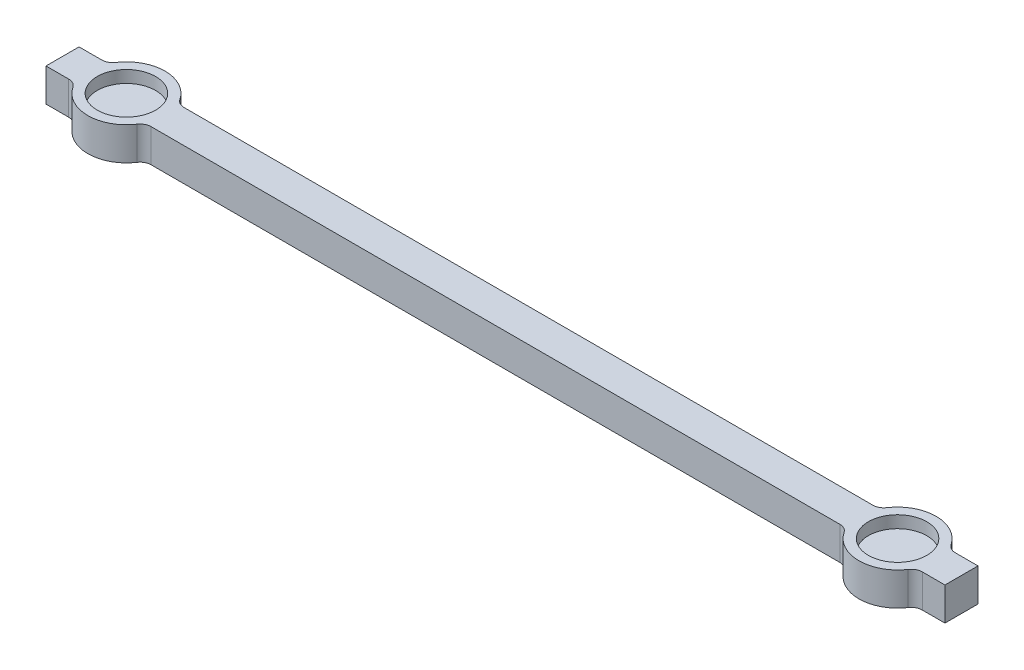
ISO-10303-21;
HEADER;
FILE_DESCRIPTION(('STEP AP214'),'2;1');
FILE_NAME('part.step','',(''),(''),'','','');
FILE_SCHEMA(('AUTOMOTIVE_DESIGN { 1 0 10303 214 1 1 1 1 }'));
ENDSEC;
DATA;
#1=APPLICATION_CONTEXT('core data for automotive mechanical design processes');
#2=APPLICATION_PROTOCOL_DEFINITION('international standard','automotive_design',2000,#1);
#3=PRODUCT_CONTEXT('',#1,'mechanical');
#4=PRODUCT('Part','Part','',(#3));
#5=PRODUCT_RELATED_PRODUCT_CATEGORY('part','',(#4));
#6=PRODUCT_DEFINITION_FORMATION('','',#4);
#7=PRODUCT_DEFINITION_CONTEXT('part definition',#1,'design');
#8=PRODUCT_DEFINITION('design','',#6,#7);
#9=PRODUCT_DEFINITION_SHAPE('','',#8);
#10=(LENGTH_UNIT() NAMED_UNIT(*) SI_UNIT(.MILLI.,.METRE.));
#11=(NAMED_UNIT(*) PLANE_ANGLE_UNIT() SI_UNIT($,.RADIAN.));
#12=(NAMED_UNIT(*) SI_UNIT($,.STERADIAN.) SOLID_ANGLE_UNIT());
#13=UNCERTAINTY_MEASURE_WITH_UNIT(LENGTH_MEASURE(1.E-05),#10,'distance_accuracy_value','');
#14=(GEOMETRIC_REPRESENTATION_CONTEXT(3) GLOBAL_UNCERTAINTY_ASSIGNED_CONTEXT((#13)) GLOBAL_UNIT_ASSIGNED_CONTEXT((#10,
#11,#12)) REPRESENTATION_CONTEXT('',''));
#15=CARTESIAN_POINT('',(0.,0.,0.));
#16=DIRECTION('',(0.,0.,1.));
#17=DIRECTION('',(1.,0.,0.));
#18=AXIS2_PLACEMENT_3D('',#15,#16,#17);
#19=CARTESIAN_POINT('',(-35.,3.,0.));
#20=DIRECTION('',(0.,-1.,0.));
#21=DIRECTION('',(0.,0.,-1.));
#22=AXIS2_PLACEMENT_3D('',#19,#20,#21);
#23=CYLINDRICAL_SURFACE('',#22,3.5);
#24=CARTESIAN_POINT('',(-35.,0.,0.));
#25=DIRECTION('',(0.,1.,0.));
#26=DIRECTION('',(0.,0.,1.));
#27=AXIS2_PLACEMENT_3D('',#24,#25,#26);
#28=CIRCLE('',#27,3.5);
#29=CARTESIAN_POINT('',(-32.0898220325091,0.,-1.94444444444444));
#30=VERTEX_POINT('',#29);
#31=CARTESIAN_POINT('',(-37.9101779674908,0.,-1.94444444444444));
#32=VERTEX_POINT('',#31);
#33=EDGE_CURVE('E352',#30,#32,#28,.T.);
#34=ORIENTED_EDGE('',*,*,#33,.T.);
#35=DIRECTION('',(0.,-1.,0.));
#36=VECTOR('',#35,1.);
#37=CARTESIAN_POINT('',(-37.9101779674908,3.,-1.94444444444444));
#38=LINE('',#37,#36);
#39=CARTESIAN_POINT('',(-37.9101779674908,3.,-1.94444444444444));
#40=VERTEX_POINT('',#39);
#41=EDGE_CURVE('E288',#32,#40,#38,.F.);
#42=ORIENTED_EDGE('',*,*,#41,.T.);
#43=CARTESIAN_POINT('',(-35.,3.,0.));
#44=DIRECTION('',(0.,1.,0.));
#45=DIRECTION('',(0.,0.,1.));
#46=AXIS2_PLACEMENT_3D('',#43,#44,#45);
#47=CIRCLE('',#46,3.5);
#48=CARTESIAN_POINT('',(-32.0898220325091,3.,-1.94444444444444));
#49=VERTEX_POINT('',#48);
#50=EDGE_CURVE('E276',#49,#40,#47,.T.);
#51=ORIENTED_EDGE('',*,*,#50,.F.);
#52=DIRECTION('',(0.,-1.,0.));
#53=VECTOR('',#52,1.);
#54=CARTESIAN_POINT('',(-32.0898220325091,3.,-1.94444444444444));
#55=LINE('',#54,#53);
#56=EDGE_CURVE('E286',#49,#30,#55,.T.);
#57=ORIENTED_EDGE('',*,*,#56,.T.);
#58=EDGE_LOOP('',(#34,#42,#51,#57));
#59=FACE_BOUND('',#58,.T.);
#60=ADVANCED_FACE('F70',(#59),#23,.T.);
#61=CARTESIAN_POINT('',(-35.,0.,0.));
#62=DIRECTION('',(0.,1.,0.));
#63=DIRECTION('',(0.,0.,1.));
#64=AXIS2_PLACEMENT_3D('',#61,#62,#63);
#65=PLANE('',#64);
#66=ORIENTED_EDGE('',*,*,#33,.F.);
#67=CARTESIAN_POINT('',(-31.258342613226,0.,-2.5));
#68=DIRECTION('',(0.,1.,0.));
#69=DIRECTION('',(0.,0.,1.));
#70=AXIS2_PLACEMENT_3D('',#67,#68,#69);
#71=CIRCLE('',#70,1.);
#72=CARTESIAN_POINT('',(-31.258342613226,0.,-1.5));
#73=VERTEX_POINT('',#72);
#74=EDGE_CURVE('E322',#30,#73,#71,.T.);
#75=ORIENTED_EDGE('',*,*,#74,.T.);
#76=DIRECTION('',(-1.,0.,0.));
#77=VECTOR('',#76,1.);
#78=CARTESIAN_POINT('',(40.8,0.,-1.5));
#79=LINE('',#78,#77);
#80=CARTESIAN_POINT('',(31.2583426132261,0.,-1.5));
#81=VERTEX_POINT('',#80);
#82=EDGE_CURVE('E238',#81,#73,#79,.T.);
#83=ORIENTED_EDGE('',*,*,#82,.F.);
#84=CARTESIAN_POINT('',(31.2583426132261,0.,-2.5));
#85=DIRECTION('',(0.,1.,0.));
#86=DIRECTION('',(0.,0.,1.));
#87=AXIS2_PLACEMENT_3D('',#84,#85,#86);
#88=CIRCLE('',#87,1.);
#89=CARTESIAN_POINT('',(32.0898220325092,0.,-1.94444444444444));
#90=VERTEX_POINT('',#89);
#91=EDGE_CURVE('E312',#81,#90,#88,.T.);
#92=ORIENTED_EDGE('',*,*,#91,.T.);
#93=CARTESIAN_POINT('',(35.,0.,0.));
#94=DIRECTION('',(0.,-1.,0.));
#95=DIRECTION('',(0.,0.,-1.));
#96=AXIS2_PLACEMENT_3D('',#93,#94,#95);
#97=CIRCLE('',#96,3.5);
#98=CARTESIAN_POINT('',(37.9101779674909,0.,-1.94444444444444));
#99=VERTEX_POINT('',#98);
#100=EDGE_CURVE('E271',#90,#99,#97,.T.);
#101=ORIENTED_EDGE('',*,*,#100,.T.);
#102=CARTESIAN_POINT('',(38.741657386774,0.,-2.5));
#103=DIRECTION('',(0.,1.,0.));
#104=DIRECTION('',(0.,0.,1.));
#105=AXIS2_PLACEMENT_3D('',#102,#103,#104);
#106=CIRCLE('',#105,1.);
#107=CARTESIAN_POINT('',(38.741657386774,0.,-1.5));
#108=VERTEX_POINT('',#107);
#109=EDGE_CURVE('E326',#99,#108,#106,.T.);
#110=ORIENTED_EDGE('',*,*,#109,.T.);
#111=CARTESIAN_POINT('',(40.8,0.,-1.5));
#112=VERTEX_POINT('',#111);
#113=EDGE_CURVE('E235',#112,#108,#79,.T.);
#114=ORIENTED_EDGE('',*,*,#113,.F.);
#115=DIRECTION('',(0.,0.,1.));
#116=VECTOR('',#115,1.);
#117=CARTESIAN_POINT('',(40.8,0.,-1.5));
#118=LINE('',#117,#116);
#119=CARTESIAN_POINT('',(40.8,0.,1.5));
#120=VERTEX_POINT('',#119);
#121=EDGE_CURVE('E250',#112,#120,#118,.T.);
#122=ORIENTED_EDGE('',*,*,#121,.T.);
#123=DIRECTION('',(-1.,0.,0.));
#124=VECTOR('',#123,1.);
#125=CARTESIAN_POINT('',(40.8,0.,1.5));
#126=LINE('',#125,#124);
#127=CARTESIAN_POINT('',(38.741657386774,0.,1.5));
#128=VERTEX_POINT('',#127);
#129=EDGE_CURVE('E212',#120,#128,#126,.T.);
#130=ORIENTED_EDGE('',*,*,#129,.T.);
#131=CARTESIAN_POINT('',(38.741657386774,0.,2.5));
#132=DIRECTION('',(0.,1.,0.));
#133=DIRECTION('',(0.,0.,1.));
#134=AXIS2_PLACEMENT_3D('',#131,#132,#133);
#135=CIRCLE('',#134,1.);
#136=CARTESIAN_POINT('',(37.9101779674909,0.,1.94444444444444));
#137=VERTEX_POINT('',#136);
#138=EDGE_CURVE('E329',#128,#137,#135,.T.);
#139=ORIENTED_EDGE('',*,*,#138,.T.);
#140=CARTESIAN_POINT('',(32.0898220325092,0.,1.94444444444444));
#141=VERTEX_POINT('',#140);
#142=EDGE_CURVE('E268',#137,#141,#97,.T.);
#143=ORIENTED_EDGE('',*,*,#142,.T.);
#144=CARTESIAN_POINT('',(31.2583426132261,0.,2.5));
#145=DIRECTION('',(0.,1.,0.));
#146=DIRECTION('',(0.,0.,1.));
#147=AXIS2_PLACEMENT_3D('',#144,#145,#146);
#148=CIRCLE('',#147,1.);
#149=CARTESIAN_POINT('',(31.2583426132261,0.,1.5));
#150=VERTEX_POINT('',#149);
#151=EDGE_CURVE('E331',#141,#150,#148,.T.);
#152=ORIENTED_EDGE('',*,*,#151,.T.);
#153=CARTESIAN_POINT('',(-31.258342613226,0.,1.5));
#154=VERTEX_POINT('',#153);
#155=EDGE_CURVE('E256',#150,#154,#126,.T.);
#156=ORIENTED_EDGE('',*,*,#155,.T.);
#157=CARTESIAN_POINT('',(-31.258342613226,0.,2.5));
#158=DIRECTION('',(0.,1.,0.));
#159=DIRECTION('',(0.,0.,1.));
#160=AXIS2_PLACEMENT_3D('',#157,#158,#159);
#161=CIRCLE('',#160,1.);
#162=CARTESIAN_POINT('',(-32.0898220325091,0.,1.94444444444444));
#163=VERTEX_POINT('',#162);
#164=EDGE_CURVE('E337',#154,#163,#161,.T.);
#165=ORIENTED_EDGE('',*,*,#164,.T.);
#166=CARTESIAN_POINT('',(-37.9101779674908,0.,1.94444444444444));
#167=VERTEX_POINT('',#166);
#168=EDGE_CURVE('E242',#167,#163,#28,.T.);
#169=ORIENTED_EDGE('',*,*,#168,.F.);
#170=CARTESIAN_POINT('',(-38.7416573867739,0.,2.5));
#171=DIRECTION('',(0.,1.,0.));
#172=DIRECTION('',(0.,0.,1.));
#173=AXIS2_PLACEMENT_3D('',#170,#171,#172);
#174=CIRCLE('',#173,1.);
#175=CARTESIAN_POINT('',(-38.7416573867739,0.,1.5));
#176=VERTEX_POINT('',#175);
#177=EDGE_CURVE('E78',#167,#176,#174,.T.);
#178=ORIENTED_EDGE('',*,*,#177,.T.);
#179=CARTESIAN_POINT('',(-40.8,0.,1.5));
#180=VERTEX_POINT('',#179);
#181=EDGE_CURVE('E252',#176,#180,#126,.T.);
#182=ORIENTED_EDGE('',*,*,#181,.T.);
#183=DIRECTION('',(0.,0.,1.));
#184=VECTOR('',#183,1.);
#185=CARTESIAN_POINT('',(-40.8,0.,-1.5));
#186=LINE('',#185,#184);
#187=CARTESIAN_POINT('',(-40.8,0.,-1.5));
#188=VERTEX_POINT('',#187);
#189=EDGE_CURVE('E255',#188,#180,#186,.T.);
#190=ORIENTED_EDGE('',*,*,#189,.F.);
#191=CARTESIAN_POINT('',(-38.7416573867739,0.,-1.5));
#192=VERTEX_POINT('',#191);
#193=EDGE_CURVE('E240',#192,#188,#79,.T.);
#194=ORIENTED_EDGE('',*,*,#193,.F.);
#195=CARTESIAN_POINT('',(-38.7416573867739,0.,-2.5));
#196=DIRECTION('',(0.,1.,0.));
#197=DIRECTION('',(0.,0.,1.));
#198=AXIS2_PLACEMENT_3D('',#195,#196,#197);
#199=CIRCLE('',#198,1.);
#200=EDGE_CURVE('E316',#192,#32,#199,.T.);
#201=ORIENTED_EDGE('',*,*,#200,.T.);
#202=EDGE_LOOP('',(#66,#75,#83,#92,#101,#110,#114,#122,#130,#139,#143,#152,#156,#165,#169,#178,
#182,#190,#194,#201));
#203=FACE_BOUND('',#202,.T.);
#204=ADVANCED_FACE('F342',(#203),#65,.F.);
#205=CARTESIAN_POINT('',(-35.,3.,0.));
#206=DIRECTION('',(0.,1.,0.));
#207=DIRECTION('',(0.,0.,1.));
#208=AXIS2_PLACEMENT_3D('',#205,#206,#207);
#209=PLANE('',#208);
#210=CARTESIAN_POINT('',(-35.,3.,0.));
#211=DIRECTION('',(0.,1.,0.));
#212=DIRECTION('',(0.,0.,1.));
#213=AXIS2_PLACEMENT_3D('',#210,#211,#212);
#214=CIRCLE('',#213,2.65);
#215=CARTESIAN_POINT('',(-35.,3.,2.65));
#216=VERTEX_POINT('',#215);
#217=EDGE_CURVE('E461',#216,#216,#214,.T.);
#218=ORIENTED_EDGE('',*,*,#217,.F.);
#219=EDGE_LOOP('',(#218));
#220=FACE_BOUND('',#219,.T.);
#221=CARTESIAN_POINT('',(35.,3.,0.));
#222=DIRECTION('',(0.,1.,0.));
#223=DIRECTION('',(0.,0.,1.));
#224=AXIS2_PLACEMENT_3D('',#221,#222,#223);
#225=CIRCLE('',#224,2.65);
#226=CARTESIAN_POINT('',(35.,3.,2.65));
#227=VERTEX_POINT('',#226);
#228=EDGE_CURVE('E469',#227,#227,#225,.T.);
#229=ORIENTED_EDGE('',*,*,#228,.F.);
#230=EDGE_LOOP('',(#229));
#231=FACE_BOUND('',#230,.T.);
#232=DIRECTION('',(-1.,0.,0.));
#233=VECTOR('',#232,1.);
#234=CARTESIAN_POINT('',(40.8,3.,-1.5));
#235=LINE('',#234,#233);
#236=CARTESIAN_POINT('',(31.2583426132261,3.,-1.5));
#237=VERTEX_POINT('',#236);
#238=CARTESIAN_POINT('',(-31.258342613226,3.,-1.5));
#239=VERTEX_POINT('',#238);
#240=EDGE_CURVE('E249',#237,#239,#235,.T.);
#241=ORIENTED_EDGE('',*,*,#240,.T.);
#242=CARTESIAN_POINT('',(-31.258342613226,3.,-2.5));
#243=DIRECTION('',(0.,1.,0.));
#244=DIRECTION('',(0.,0.,1.));
#245=AXIS2_PLACEMENT_3D('',#242,#243,#244);
#246=CIRCLE('',#245,1.);
#247=EDGE_CURVE('E320',#239,#49,#246,.F.);
#248=ORIENTED_EDGE('',*,*,#247,.T.);
#249=ORIENTED_EDGE('',*,*,#50,.T.);
#250=CARTESIAN_POINT('',(-38.7416573867739,3.,-2.5));
#251=DIRECTION('',(0.,1.,0.));
#252=DIRECTION('',(0.,0.,1.));
#253=AXIS2_PLACEMENT_3D('',#250,#251,#252);
#254=CIRCLE('',#253,1.);
#255=CARTESIAN_POINT('',(-38.7416573867739,3.,-1.5));
#256=VERTEX_POINT('',#255);
#257=EDGE_CURVE('E318',#40,#256,#254,.F.);
#258=ORIENTED_EDGE('',*,*,#257,.T.);
#259=CARTESIAN_POINT('',(-40.8,3.,-1.5));
#260=VERTEX_POINT('',#259);
#261=EDGE_CURVE('E247',#256,#260,#235,.T.);
#262=ORIENTED_EDGE('',*,*,#261,.T.);
#263=DIRECTION('',(0.,0.,1.));
#264=VECTOR('',#263,1.);
#265=CARTESIAN_POINT('',(-40.8,3.,-1.5));
#266=LINE('',#265,#264);
#267=CARTESIAN_POINT('',(-40.8,3.,1.5));
#268=VERTEX_POINT('',#267);
#269=EDGE_CURVE('E228',#260,#268,#266,.T.);
#270=ORIENTED_EDGE('',*,*,#269,.T.);
#271=DIRECTION('',(-1.,0.,0.));
#272=VECTOR('',#271,1.);
#273=CARTESIAN_POINT('',(40.8,3.,1.5));
#274=LINE('',#273,#272);
#275=CARTESIAN_POINT('',(-38.7416573867739,3.,1.5));
#276=VERTEX_POINT('',#275);
#277=EDGE_CURVE('E231',#276,#268,#274,.T.);
#278=ORIENTED_EDGE('',*,*,#277,.F.);
#279=CARTESIAN_POINT('',(-38.7416573867739,3.,2.5));
#280=DIRECTION('',(0.,1.,0.));
#281=DIRECTION('',(0.,0.,1.));
#282=AXIS2_PLACEMENT_3D('',#279,#280,#281);
#283=CIRCLE('',#282,1.);
#284=CARTESIAN_POINT('',(-37.9101779674908,3.,1.94444444444444));
#285=VERTEX_POINT('',#284);
#286=EDGE_CURVE('E12',#276,#285,#283,.F.);
#287=ORIENTED_EDGE('',*,*,#286,.T.);
#288=CARTESIAN_POINT('',(-32.0898220325091,3.,1.94444444444444));
#289=VERTEX_POINT('',#288);
#290=EDGE_CURVE('E357',#285,#289,#47,.T.);
#291=ORIENTED_EDGE('',*,*,#290,.T.);
#292=CARTESIAN_POINT('',(-31.258342613226,3.,2.5));
#293=DIRECTION('',(0.,1.,0.));
#294=DIRECTION('',(0.,0.,1.));
#295=AXIS2_PLACEMENT_3D('',#292,#293,#294);
#296=CIRCLE('',#295,1.);
#297=CARTESIAN_POINT('',(-31.258342613226,3.,1.5));
#298=VERTEX_POINT('',#297);
#299=EDGE_CURVE('E335',#289,#298,#296,.F.);
#300=ORIENTED_EDGE('',*,*,#299,.T.);
#301=CARTESIAN_POINT('',(31.2583426132261,3.,1.5));
#302=VERTEX_POINT('',#301);
#303=EDGE_CURVE('E229',#302,#298,#274,.T.);
#304=ORIENTED_EDGE('',*,*,#303,.F.);
#305=CARTESIAN_POINT('',(31.2583426132261,3.,2.5));
#306=DIRECTION('',(0.,1.,0.));
#307=DIRECTION('',(0.,0.,1.));
#308=AXIS2_PLACEMENT_3D('',#305,#306,#307);
#309=CIRCLE('',#308,1.);
#310=CARTESIAN_POINT('',(32.0898220325092,3.,1.94444444444444));
#311=VERTEX_POINT('',#310);
#312=EDGE_CURVE('E333',#302,#311,#309,.F.);
#313=ORIENTED_EDGE('',*,*,#312,.T.);
#314=CARTESIAN_POINT('',(35.,3.,0.));
#315=DIRECTION('',(0.,-1.,0.));
#316=DIRECTION('',(0.,0.,-1.));
#317=AXIS2_PLACEMENT_3D('',#314,#315,#316);
#318=CIRCLE('',#317,3.5);
#319=CARTESIAN_POINT('',(37.9101779674909,3.,1.94444444444444));
#320=VERTEX_POINT('',#319);
#321=EDGE_CURVE('E253',#320,#311,#318,.T.);
#322=ORIENTED_EDGE('',*,*,#321,.F.);
#323=CARTESIAN_POINT('',(38.741657386774,3.,2.5));
#324=DIRECTION('',(0.,1.,0.));
#325=DIRECTION('',(0.,0.,1.));
#326=AXIS2_PLACEMENT_3D('',#323,#324,#325);
#327=CIRCLE('',#326,1.);
#328=CARTESIAN_POINT('',(38.741657386774,3.,1.5));
#329=VERTEX_POINT('',#328);
#330=EDGE_CURVE('E227',#320,#329,#327,.F.);
#331=ORIENTED_EDGE('',*,*,#330,.T.);
#332=CARTESIAN_POINT('',(40.8,3.,1.5));
#333=VERTEX_POINT('',#332);
#334=EDGE_CURVE('E209',#333,#329,#274,.T.);
#335=ORIENTED_EDGE('',*,*,#334,.F.);
#336=DIRECTION('',(0.,0.,1.));
#337=VECTOR('',#336,1.);
#338=CARTESIAN_POINT('',(40.8,3.,-1.5));
#339=LINE('',#338,#337);
#340=CARTESIAN_POINT('',(40.8,3.,-1.5));
#341=VERTEX_POINT('',#340);
#342=EDGE_CURVE('E225',#341,#333,#339,.T.);
#343=ORIENTED_EDGE('',*,*,#342,.F.);
#344=CARTESIAN_POINT('',(38.741657386774,3.,-1.5));
#345=VERTEX_POINT('',#344);
#346=EDGE_CURVE('E218',#341,#345,#235,.T.);
#347=ORIENTED_EDGE('',*,*,#346,.T.);
#348=CARTESIAN_POINT('',(38.741657386774,3.,-2.5));
#349=DIRECTION('',(0.,1.,0.));
#350=DIRECTION('',(0.,0.,1.));
#351=AXIS2_PLACEMENT_3D('',#348,#349,#350);
#352=CIRCLE('',#351,1.);
#353=CARTESIAN_POINT('',(37.9101779674909,3.,-1.94444444444444));
#354=VERTEX_POINT('',#353);
#355=EDGE_CURVE('E324',#345,#354,#352,.F.);
#356=ORIENTED_EDGE('',*,*,#355,.T.);
#357=CARTESIAN_POINT('',(32.0898220325092,3.,-1.94444444444444));
#358=VERTEX_POINT('',#357);
#359=EDGE_CURVE('E267',#358,#354,#318,.T.);
#360=ORIENTED_EDGE('',*,*,#359,.F.);
#361=CARTESIAN_POINT('',(31.2583426132261,3.,-2.5));
#362=DIRECTION('',(0.,1.,0.));
#363=DIRECTION('',(0.,0.,1.));
#364=AXIS2_PLACEMENT_3D('',#361,#362,#363);
#365=CIRCLE('',#364,1.);
#366=EDGE_CURVE('E314',#358,#237,#365,.F.);
#367=ORIENTED_EDGE('',*,*,#366,.T.);
#368=EDGE_LOOP('',(#241,#248,#249,#258,#262,#270,#278,#287,#291,#300,#304,#313,#322,#331,#335,
#343,#347,#356,#360,#367));
#369=FACE_BOUND('',#368,.T.);
#370=ADVANCED_FACE('F223',(#220,#231,#369),#209,.T.);
#371=ORIENTED_EDGE('',*,*,#168,.T.);
#372=DIRECTION('',(0.,-1.,0.));
#373=VECTOR('',#372,1.);
#374=CARTESIAN_POINT('',(-32.0898220325091,3.,1.94444444444444));
#375=LINE('',#374,#373);
#376=EDGE_CURVE('E308',#163,#289,#375,.F.);
#377=ORIENTED_EDGE('',*,*,#376,.T.);
#378=ORIENTED_EDGE('',*,*,#290,.F.);
#379=DIRECTION('',(0.,-1.,0.));
#380=VECTOR('',#379,1.);
#381=CARTESIAN_POINT('',(-37.9101779674908,3.,1.94444444444444));
#382=LINE('',#381,#380);
#383=EDGE_CURVE('E305',#285,#167,#382,.T.);
#384=ORIENTED_EDGE('',*,*,#383,.T.);
#385=EDGE_LOOP('',(#371,#377,#378,#384));
#386=FACE_BOUND('',#385,.T.);
#387=ADVANCED_FACE('F348',(#386),#23,.T.);
#388=CARTESIAN_POINT('',(-40.8,3.,-1.5));
#389=DIRECTION('',(1.,0.,0.));
#390=DIRECTION('',(0.,0.,-1.));
#391=AXIS2_PLACEMENT_3D('',#388,#389,#390);
#392=PLANE('',#391);
#393=ORIENTED_EDGE('',*,*,#189,.T.);
#394=DIRECTION('',(0.,-1.,0.));
#395=VECTOR('',#394,1.);
#396=CARTESIAN_POINT('',(-40.8,3.,1.5));
#397=LINE('',#396,#395);
#398=EDGE_CURVE('E217',#268,#180,#397,.T.);
#399=ORIENTED_EDGE('',*,*,#398,.F.);
#400=ORIENTED_EDGE('',*,*,#269,.F.);
#401=DIRECTION('',(0.,-1.,0.));
#402=VECTOR('',#401,1.);
#403=CARTESIAN_POINT('',(-40.8,3.,-1.5));
#404=LINE('',#403,#402);
#405=EDGE_CURVE('E260',#260,#188,#404,.T.);
#406=ORIENTED_EDGE('',*,*,#405,.T.);
#407=EDGE_LOOP('',(#393,#399,#400,#406));
#408=FACE_BOUND('',#407,.T.);
#409=ADVANCED_FACE('F408',(#408),#392,.F.);
#410=CARTESIAN_POINT('',(40.8,3.,1.5));
#411=DIRECTION('',(0.,0.,1.));
#412=DIRECTION('',(1.,0.,0.));
#413=AXIS2_PLACEMENT_3D('',#410,#411,#412);
#414=PLANE('',#413);
#415=ORIENTED_EDGE('',*,*,#181,.F.);
#416=DIRECTION('',(0.,-1.,0.));
#417=VECTOR('',#416,1.);
#418=CARTESIAN_POINT('',(-38.7416573867739,3.,1.5));
#419=LINE('',#418,#417);
#420=EDGE_CURVE('E91',#176,#276,#419,.F.);
#421=ORIENTED_EDGE('',*,*,#420,.T.);
#422=ORIENTED_EDGE('',*,*,#277,.T.);
#423=ORIENTED_EDGE('',*,*,#398,.T.);
#424=EDGE_LOOP('',(#415,#421,#422,#423));
#425=FACE_BOUND('',#424,.T.);
#426=ADVANCED_FACE('F409',(#425),#414,.T.);
#427=CARTESIAN_POINT('',(40.8,3.,-1.5));
#428=DIRECTION('',(0.,0.,1.));
#429=DIRECTION('',(1.,0.,0.));
#430=AXIS2_PLACEMENT_3D('',#427,#428,#429);
#431=PLANE('',#430);
#432=ORIENTED_EDGE('',*,*,#261,.F.);
#433=DIRECTION('',(0.,1.,0.));
#434=VECTOR('',#433,1.);
#435=CARTESIAN_POINT('',(-38.7416573867739,0.,-1.5));
#436=LINE('',#435,#434);
#437=EDGE_CURVE('E283',#256,#192,#436,.F.);
#438=ORIENTED_EDGE('',*,*,#437,.T.);
#439=ORIENTED_EDGE('',*,*,#193,.T.);
#440=ORIENTED_EDGE('',*,*,#405,.F.);
#441=EDGE_LOOP('',(#432,#438,#439,#440));
#442=FACE_BOUND('',#441,.T.);
#443=ADVANCED_FACE('F404',(#442),#431,.F.);
#444=CARTESIAN_POINT('',(40.8,3.,-1.5));
#445=DIRECTION('',(1.,0.,0.));
#446=DIRECTION('',(0.,0.,-1.));
#447=AXIS2_PLACEMENT_3D('',#444,#445,#446);
#448=PLANE('',#447);
#449=ORIENTED_EDGE('',*,*,#121,.F.);
#450=DIRECTION('',(0.,-1.,0.));
#451=VECTOR('',#450,1.);
#452=CARTESIAN_POINT('',(40.8,3.,-1.5));
#453=LINE('',#452,#451);
#454=EDGE_CURVE('E233',#341,#112,#453,.T.);
#455=ORIENTED_EDGE('',*,*,#454,.F.);
#456=ORIENTED_EDGE('',*,*,#342,.T.);
#457=DIRECTION('',(0.,-1.,0.));
#458=VECTOR('',#457,1.);
#459=CARTESIAN_POINT('',(40.8,3.,1.5));
#460=LINE('',#459,#458);
#461=EDGE_CURVE('E206',#333,#120,#460,.T.);
#462=ORIENTED_EDGE('',*,*,#461,.T.);
#463=EDGE_LOOP('',(#449,#455,#456,#462));
#464=FACE_BOUND('',#463,.T.);
#465=ADVANCED_FACE('F232',(#464),#448,.T.);
#466=ORIENTED_EDGE('',*,*,#113,.T.);
#467=DIRECTION('',(0.,-1.,0.));
#468=VECTOR('',#467,1.);
#469=CARTESIAN_POINT('',(38.741657386774,3.,-1.5));
#470=LINE('',#469,#468);
#471=EDGE_CURVE('E290',#108,#345,#470,.F.);
#472=ORIENTED_EDGE('',*,*,#471,.T.);
#473=ORIENTED_EDGE('',*,*,#346,.F.);
#474=ORIENTED_EDGE('',*,*,#454,.T.);
#475=EDGE_LOOP('',(#466,#472,#473,#474));
#476=FACE_BOUND('',#475,.T.);
#477=ADVANCED_FACE('F376',(#476),#431,.F.);
#478=ORIENTED_EDGE('',*,*,#334,.T.);
#479=DIRECTION('',(0.,1.,0.));
#480=VECTOR('',#479,1.);
#481=CARTESIAN_POINT('',(38.741657386774,0.,1.5));
#482=LINE('',#481,#480);
#483=EDGE_CURVE('E299',#329,#128,#482,.F.);
#484=ORIENTED_EDGE('',*,*,#483,.T.);
#485=ORIENTED_EDGE('',*,*,#129,.F.);
#486=ORIENTED_EDGE('',*,*,#461,.F.);
#487=EDGE_LOOP('',(#478,#484,#485,#486));
#488=FACE_BOUND('',#487,.T.);
#489=ADVANCED_FACE('F208',(#488),#414,.T.);
#490=CARTESIAN_POINT('',(35.,3.,0.));
#491=DIRECTION('',(0.,-1.,0.));
#492=DIRECTION('',(0.,0.,-1.));
#493=AXIS2_PLACEMENT_3D('',#490,#491,#492);
#494=CYLINDRICAL_SURFACE('',#493,3.5);
#495=ORIENTED_EDGE('',*,*,#100,.F.);
#496=DIRECTION('',(0.,-1.,0.));
#497=VECTOR('',#496,1.);
#498=CARTESIAN_POINT('',(32.0898220325092,3.,-1.94444444444444));
#499=LINE('',#498,#497);
#500=EDGE_CURVE('E281',#90,#358,#499,.F.);
#501=ORIENTED_EDGE('',*,*,#500,.T.);
#502=ORIENTED_EDGE('',*,*,#359,.T.);
#503=DIRECTION('',(0.,-1.,0.));
#504=VECTOR('',#503,1.);
#505=CARTESIAN_POINT('',(37.9101779674909,3.,-1.94444444444444));
#506=LINE('',#505,#504);
#507=EDGE_CURVE('E279',#354,#99,#506,.T.);
#508=ORIENTED_EDGE('',*,*,#507,.T.);
#509=EDGE_LOOP('',(#495,#501,#502,#508));
#510=FACE_BOUND('',#509,.T.);
#511=ADVANCED_FACE('F385',(#510),#494,.T.);
#512=ORIENTED_EDGE('',*,*,#142,.F.);
#513=DIRECTION('',(0.,-1.,0.));
#514=VECTOR('',#513,1.);
#515=CARTESIAN_POINT('',(37.9101779674909,3.,1.94444444444444));
#516=LINE('',#515,#514);
#517=EDGE_CURVE('E296',#137,#320,#516,.F.);
#518=ORIENTED_EDGE('',*,*,#517,.T.);
#519=ORIENTED_EDGE('',*,*,#321,.T.);
#520=DIRECTION('',(0.,-1.,0.));
#521=VECTOR('',#520,1.);
#522=CARTESIAN_POINT('',(32.0898220325092,3.,1.94444444444444));
#523=LINE('',#522,#521);
#524=EDGE_CURVE('E293',#311,#141,#523,.T.);
#525=ORIENTED_EDGE('',*,*,#524,.T.);
#526=EDGE_LOOP('',(#512,#518,#519,#525));
#527=FACE_BOUND('',#526,.T.);
#528=ADVANCED_FACE('F366',(#527),#494,.T.);
#529=ORIENTED_EDGE('',*,*,#240,.F.);
#530=DIRECTION('',(0.,-1.,0.));
#531=VECTOR('',#530,1.);
#532=CARTESIAN_POINT('',(31.2583426132261,3.,-1.5));
#533=LINE('',#532,#531);
#534=EDGE_CURVE('E275',#237,#81,#533,.T.);
#535=ORIENTED_EDGE('',*,*,#534,.T.);
#536=ORIENTED_EDGE('',*,*,#82,.T.);
#537=DIRECTION('',(0.,1.,0.));
#538=VECTOR('',#537,1.);
#539=CARTESIAN_POINT('',(-31.258342613226,3.,-1.5));
#540=LINE('',#539,#538);
#541=EDGE_CURVE('E272',#73,#239,#540,.T.);
#542=ORIENTED_EDGE('',*,*,#541,.T.);
#543=EDGE_LOOP('',(#529,#535,#536,#542));
#544=FACE_BOUND('',#543,.T.);
#545=ADVANCED_FACE('F392',(#544),#431,.F.);
#546=ORIENTED_EDGE('',*,*,#155,.F.);
#547=DIRECTION('',(0.,1.,0.));
#548=VECTOR('',#547,1.);
#549=CARTESIAN_POINT('',(31.2583426132261,3.,1.5));
#550=LINE('',#549,#548);
#551=EDGE_CURVE('E303',#150,#302,#550,.T.);
#552=ORIENTED_EDGE('',*,*,#551,.T.);
#553=ORIENTED_EDGE('',*,*,#303,.T.);
#554=DIRECTION('',(0.,-1.,0.));
#555=VECTOR('',#554,1.);
#556=CARTESIAN_POINT('',(-31.258342613226,3.,1.5));
#557=LINE('',#556,#555);
#558=EDGE_CURVE('E301',#298,#154,#557,.T.);
#559=ORIENTED_EDGE('',*,*,#558,.T.);
#560=EDGE_LOOP('',(#546,#552,#553,#559));
#561=FACE_BOUND('',#560,.T.);
#562=ADVANCED_FACE('F359',(#561),#414,.T.);
#563=CARTESIAN_POINT('',(35.,1.9,0.));
#564=DIRECTION('',(0.,1.,0.));
#565=DIRECTION('',(0.,0.,1.));
#566=AXIS2_PLACEMENT_3D('',#563,#564,#565);
#567=CYLINDRICAL_SURFACE('',#566,2.65);
#568=CARTESIAN_POINT('',(35.,1.9,0.));
#569=DIRECTION('',(0.,1.,0.));
#570=DIRECTION('',(0.,0.,1.));
#571=AXIS2_PLACEMENT_3D('',#568,#569,#570);
#572=CIRCLE('',#571,2.65);
#573=CARTESIAN_POINT('',(35.,1.9,2.65));
#574=VERTEX_POINT('',#573);
#575=EDGE_CURVE('E464',#574,#574,#572,.T.);
#576=ORIENTED_EDGE('',*,*,#575,.F.);
#577=EDGE_LOOP('',(#576));
#578=FACE_BOUND('',#577,.T.);
#579=ORIENTED_EDGE('',*,*,#228,.T.);
#580=EDGE_LOOP('',(#579));
#581=FACE_BOUND('',#580,.T.);
#582=ADVANCED_FACE('F438',(#578,#581),#567,.F.);
#583=CARTESIAN_POINT('',(35.,1.9,0.));
#584=DIRECTION('',(0.,1.,0.));
#585=DIRECTION('',(0.,0.,1.));
#586=AXIS2_PLACEMENT_3D('',#583,#584,#585);
#587=PLANE('',#586);
#588=ORIENTED_EDGE('',*,*,#575,.T.);
#589=EDGE_LOOP('',(#588));
#590=FACE_BOUND('',#589,.T.);
#591=ADVANCED_FACE('F441',(#590),#587,.T.);
#592=CARTESIAN_POINT('',(-35.,1.9,0.));
#593=DIRECTION('',(0.,1.,0.));
#594=DIRECTION('',(0.,0.,1.));
#595=AXIS2_PLACEMENT_3D('',#592,#593,#594);
#596=CYLINDRICAL_SURFACE('',#595,2.65);
#597=CARTESIAN_POINT('',(-35.,1.9,0.));
#598=DIRECTION('',(0.,1.,0.));
#599=DIRECTION('',(0.,0.,1.));
#600=AXIS2_PLACEMENT_3D('',#597,#598,#599);
#601=CIRCLE('',#600,2.65);
#602=CARTESIAN_POINT('',(-35.,1.9,2.65));
#603=VERTEX_POINT('',#602);
#604=EDGE_CURVE('E460',#603,#603,#601,.T.);
#605=ORIENTED_EDGE('',*,*,#604,.F.);
#606=EDGE_LOOP('',(#605));
#607=FACE_BOUND('',#606,.T.);
#608=ORIENTED_EDGE('',*,*,#217,.T.);
#609=EDGE_LOOP('',(#608));
#610=FACE_BOUND('',#609,.T.);
#611=ADVANCED_FACE('F445',(#607,#610),#596,.F.);
#612=CARTESIAN_POINT('',(-35.,1.9,0.));
#613=DIRECTION('',(0.,1.,0.));
#614=DIRECTION('',(0.,0.,1.));
#615=AXIS2_PLACEMENT_3D('',#612,#613,#614);
#616=PLANE('',#615);
#617=ORIENTED_EDGE('',*,*,#604,.T.);
#618=EDGE_LOOP('',(#617));
#619=FACE_BOUND('',#618,.T.);
#620=ADVANCED_FACE('F449',(#619),#616,.T.);
#621=CARTESIAN_POINT('',(31.2583426132261,3.,-2.5));
#622=DIRECTION('',(0.,-1.,0.));
#623=DIRECTION('',(0.,0.,-1.));
#624=AXIS2_PLACEMENT_3D('',#621,#622,#623);
#625=CYLINDRICAL_SURFACE('',#624,1.);
#626=ORIENTED_EDGE('',*,*,#366,.F.);
#627=ORIENTED_EDGE('',*,*,#500,.F.);
#628=ORIENTED_EDGE('',*,*,#91,.F.);
#629=ORIENTED_EDGE('',*,*,#534,.F.);
#630=EDGE_LOOP('',(#626,#627,#628,#629));
#631=FACE_BOUND('',#630,.T.);
#632=ADVANCED_FACE('F388',(#631),#625,.F.);
#633=CARTESIAN_POINT('',(-38.7416573867739,3.,-2.5));
#634=DIRECTION('',(0.,-1.,0.));
#635=DIRECTION('',(0.,0.,-1.));
#636=AXIS2_PLACEMENT_3D('',#633,#634,#635);
#637=CYLINDRICAL_SURFACE('',#636,1.);
#638=ORIENTED_EDGE('',*,*,#257,.F.);
#639=ORIENTED_EDGE('',*,*,#41,.F.);
#640=ORIENTED_EDGE('',*,*,#200,.F.);
#641=ORIENTED_EDGE('',*,*,#437,.F.);
#642=EDGE_LOOP('',(#638,#639,#640,#641));
#643=FACE_BOUND('',#642,.T.);
#644=ADVANCED_FACE('F456',(#643),#637,.F.);
#645=CARTESIAN_POINT('',(-31.258342613226,3.,-2.5));
#646=DIRECTION('',(0.,-1.,0.));
#647=DIRECTION('',(0.,0.,-1.));
#648=AXIS2_PLACEMENT_3D('',#645,#646,#647);
#649=CYLINDRICAL_SURFACE('',#648,1.);
#650=ORIENTED_EDGE('',*,*,#74,.F.);
#651=ORIENTED_EDGE('',*,*,#56,.F.);
#652=ORIENTED_EDGE('',*,*,#247,.F.);
#653=ORIENTED_EDGE('',*,*,#541,.F.);
#654=EDGE_LOOP('',(#650,#651,#652,#653));
#655=FACE_BOUND('',#654,.T.);
#656=ADVANCED_FACE('F477',(#655),#649,.F.);
#657=CARTESIAN_POINT('',(38.741657386774,3.,-2.5));
#658=DIRECTION('',(0.,-1.,0.));
#659=DIRECTION('',(0.,0.,-1.));
#660=AXIS2_PLACEMENT_3D('',#657,#658,#659);
#661=CYLINDRICAL_SURFACE('',#660,1.);
#662=ORIENTED_EDGE('',*,*,#109,.F.);
#663=ORIENTED_EDGE('',*,*,#507,.F.);
#664=ORIENTED_EDGE('',*,*,#355,.F.);
#665=ORIENTED_EDGE('',*,*,#471,.F.);
#666=EDGE_LOOP('',(#662,#663,#664,#665));
#667=FACE_BOUND('',#666,.T.);
#668=ADVANCED_FACE('F378',(#667),#661,.F.);
#669=CARTESIAN_POINT('',(38.741657386774,3.,2.5));
#670=DIRECTION('',(0.,-1.,0.));
#671=DIRECTION('',(0.,0.,-1.));
#672=AXIS2_PLACEMENT_3D('',#669,#670,#671);
#673=CYLINDRICAL_SURFACE('',#672,1.);
#674=ORIENTED_EDGE('',*,*,#138,.F.);
#675=ORIENTED_EDGE('',*,*,#483,.F.);
#676=ORIENTED_EDGE('',*,*,#330,.F.);
#677=ORIENTED_EDGE('',*,*,#517,.F.);
#678=EDGE_LOOP('',(#674,#675,#676,#677));
#679=FACE_BOUND('',#678,.T.);
#680=ADVANCED_FACE('F370',(#679),#673,.F.);
#681=CARTESIAN_POINT('',(31.2583426132261,3.,2.5));
#682=DIRECTION('',(0.,-1.,0.));
#683=DIRECTION('',(0.,0.,-1.));
#684=AXIS2_PLACEMENT_3D('',#681,#682,#683);
#685=CYLINDRICAL_SURFACE('',#684,1.);
#686=ORIENTED_EDGE('',*,*,#312,.F.);
#687=ORIENTED_EDGE('',*,*,#551,.F.);
#688=ORIENTED_EDGE('',*,*,#151,.F.);
#689=ORIENTED_EDGE('',*,*,#524,.F.);
#690=EDGE_LOOP('',(#686,#687,#688,#689));
#691=FACE_BOUND('',#690,.T.);
#692=ADVANCED_FACE('F362',(#691),#685,.F.);
#693=CARTESIAN_POINT('',(-31.258342613226,3.,2.5));
#694=DIRECTION('',(0.,-1.,0.));
#695=DIRECTION('',(0.,0.,-1.));
#696=AXIS2_PLACEMENT_3D('',#693,#694,#695);
#697=CYLINDRICAL_SURFACE('',#696,1.);
#698=ORIENTED_EDGE('',*,*,#164,.F.);
#699=ORIENTED_EDGE('',*,*,#558,.F.);
#700=ORIENTED_EDGE('',*,*,#299,.F.);
#701=ORIENTED_EDGE('',*,*,#376,.F.);
#702=EDGE_LOOP('',(#698,#699,#700,#701));
#703=FACE_BOUND('',#702,.T.);
#704=ADVANCED_FACE('F353',(#703),#697,.F.);
#705=CARTESIAN_POINT('',(-38.7416573867739,3.,2.5));
#706=DIRECTION('',(0.,-1.,0.));
#707=DIRECTION('',(0.,0.,-1.));
#708=AXIS2_PLACEMENT_3D('',#705,#706,#707);
#709=CYLINDRICAL_SURFACE('',#708,1.);
#710=ORIENTED_EDGE('',*,*,#286,.F.);
#711=ORIENTED_EDGE('',*,*,#420,.F.);
#712=ORIENTED_EDGE('',*,*,#177,.F.);
#713=ORIENTED_EDGE('',*,*,#383,.F.);
#714=EDGE_LOOP('',(#710,#711,#712,#713));
#715=FACE_BOUND('',#714,.T.);
#716=ADVANCED_FACE('F72',(#715),#709,.F.);
#717=CLOSED_SHELL('',(#60,#204,#370,#387,#409,#426,#443,#465,#477,#489,#511,#528,#545,#562,#582,
#591,#611,#620,#632,#644,#656,#668,#680,#692,#704,#716));
#718=MANIFOLD_SOLID_BREP('B2',#717);
#719=ADVANCED_BREP_SHAPE_REPRESENTATION('',(#18,#718),#14);
#720=SHAPE_DEFINITION_REPRESENTATION(#9,#719);
ENDSEC;
END-ISO-10303-21;
